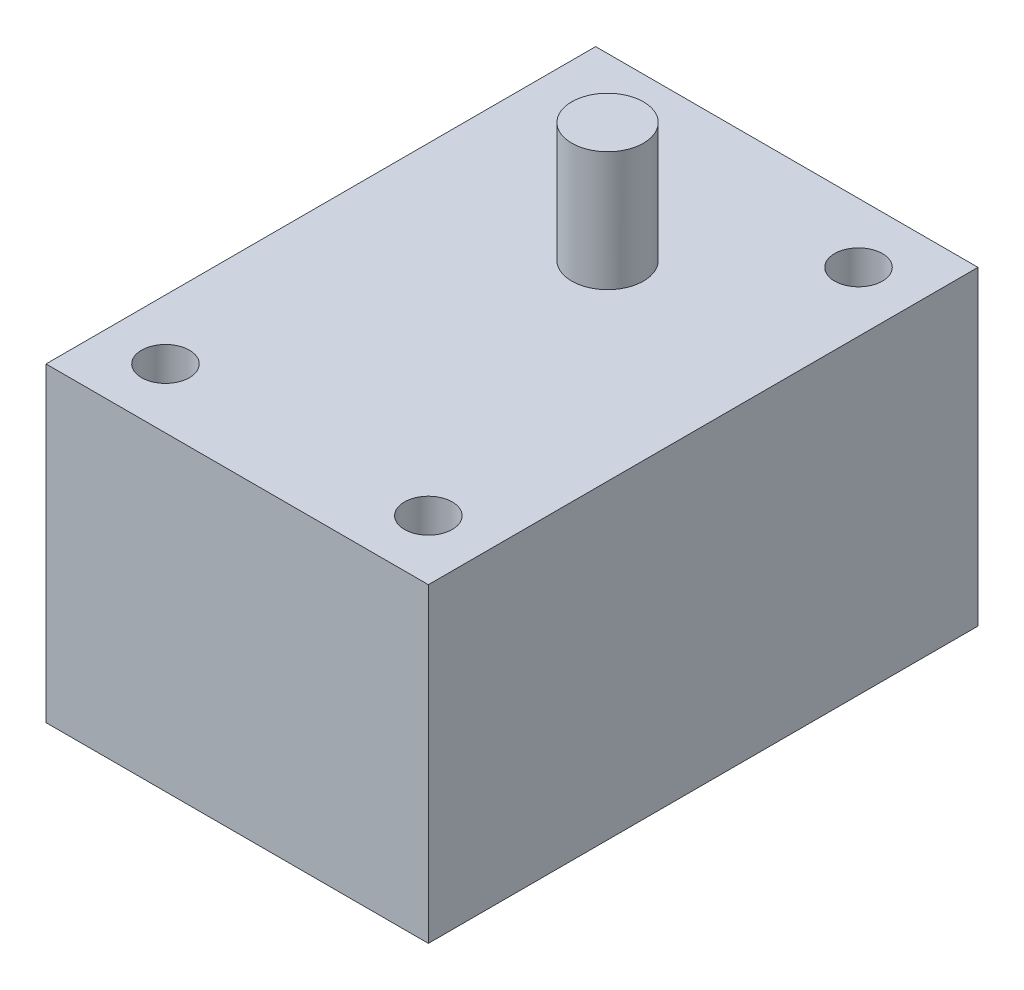
ISO-10303-21;
HEADER;
FILE_DESCRIPTION(('STEP AP214'),'2;1');
FILE_NAME('part.step','',(''),(''),'','','');
FILE_SCHEMA(('AUTOMOTIVE_DESIGN { 1 0 10303 214 1 1 1 1 }'));
ENDSEC;
DATA;
#1=APPLICATION_CONTEXT('core data for automotive mechanical design processes');
#2=APPLICATION_PROTOCOL_DEFINITION('international standard','automotive_design',2000,#1);
#3=PRODUCT_CONTEXT('',#1,'mechanical');
#4=PRODUCT('Part','Part','',(#3));
#5=PRODUCT_RELATED_PRODUCT_CATEGORY('part','',(#4));
#6=PRODUCT_DEFINITION_FORMATION('','',#4);
#7=PRODUCT_DEFINITION_CONTEXT('part definition',#1,'design');
#8=PRODUCT_DEFINITION('design','',#6,#7);
#9=PRODUCT_DEFINITION_SHAPE('','',#8);
#10=(LENGTH_UNIT() NAMED_UNIT(*) SI_UNIT(.MILLI.,.METRE.));
#11=(NAMED_UNIT(*) PLANE_ANGLE_UNIT() SI_UNIT($,.RADIAN.));
#12=(NAMED_UNIT(*) SI_UNIT($,.STERADIAN.) SOLID_ANGLE_UNIT());
#13=UNCERTAINTY_MEASURE_WITH_UNIT(LENGTH_MEASURE(1.E-05),#10,'distance_accuracy_value','');
#14=(GEOMETRIC_REPRESENTATION_CONTEXT(3) GLOBAL_UNCERTAINTY_ASSIGNED_CONTEXT((#13)) GLOBAL_UNIT_ASSIGNED_CONTEXT((#10,
#11,#12)) REPRESENTATION_CONTEXT('',''));
#15=CARTESIAN_POINT('',(0.,0.,0.));
#16=DIRECTION('',(0.,0.,1.));
#17=DIRECTION('',(1.,0.,0.));
#18=AXIS2_PLACEMENT_3D('',#15,#16,#17);
#19=CARTESIAN_POINT('',(0.,0.,46.));
#20=DIRECTION('',(1.,0.,0.));
#21=DIRECTION('',(0.,0.,-1.));
#22=AXIS2_PLACEMENT_3D('',#19,#20,#21);
#23=PLANE('',#22);
#24=DIRECTION('',(0.,-1.,0.));
#25=VECTOR('',#24,1.);
#26=CARTESIAN_POINT('',(0.,0.,0.));
#27=LINE('',#26,#25);
#28=CARTESIAN_POINT('',(0.,26.,0.));
#29=VERTEX_POINT('',#28);
#30=CARTESIAN_POINT('',(0.,0.,0.));
#31=VERTEX_POINT('',#30);
#32=EDGE_CURVE('E100',#29,#31,#27,.T.);
#33=ORIENTED_EDGE('',*,*,#32,.T.);
#34=DIRECTION('',(0.,0.,-1.));
#35=VECTOR('',#34,1.);
#36=CARTESIAN_POINT('',(0.,0.,46.));
#37=LINE('',#36,#35);
#38=CARTESIAN_POINT('',(0.,0.,46.));
#39=VERTEX_POINT('',#38);
#40=EDGE_CURVE('E42',#39,#31,#37,.T.);
#41=ORIENTED_EDGE('',*,*,#40,.F.);
#42=DIRECTION('',(0.,-1.,0.));
#43=VECTOR('',#42,1.);
#44=CARTESIAN_POINT('',(0.,0.,46.));
#45=LINE('',#44,#43);
#46=CARTESIAN_POINT('',(0.,26.,46.));
#47=VERTEX_POINT('',#46);
#48=EDGE_CURVE('E86',#47,#39,#45,.T.);
#49=ORIENTED_EDGE('',*,*,#48,.F.);
#50=DIRECTION('',(0.,0.,-1.));
#51=VECTOR('',#50,1.);
#52=CARTESIAN_POINT('',(0.,26.,46.));
#53=LINE('',#52,#51);
#54=EDGE_CURVE('E96',#47,#29,#53,.T.);
#55=ORIENTED_EDGE('',*,*,#54,.T.);
#56=EDGE_LOOP('',(#33,#41,#49,#55));
#57=FACE_BOUND('',#56,.T.);
#58=ADVANCED_FACE('F34',(#57),#23,.F.);
#59=CARTESIAN_POINT('',(0.,0.,46.));
#60=DIRECTION('',(0.,1.,0.));
#61=DIRECTION('',(0.,0.,1.));
#62=AXIS2_PLACEMENT_3D('',#59,#60,#61);
#63=PLANE('',#62);
#64=DIRECTION('',(1.,0.,0.));
#65=VECTOR('',#64,1.);
#66=CARTESIAN_POINT('',(0.,0.,0.));
#67=LINE('',#66,#65);
#68=CARTESIAN_POINT('',(32.,0.,0.));
#69=VERTEX_POINT('',#68);
#70=EDGE_CURVE('E91',#31,#69,#67,.T.);
#71=ORIENTED_EDGE('',*,*,#70,.T.);
#72=DIRECTION('',(0.,0.,-1.));
#73=VECTOR('',#72,1.);
#74=CARTESIAN_POINT('',(32.,0.,46.));
#75=LINE('',#74,#73);
#76=CARTESIAN_POINT('',(32.,0.,46.));
#77=VERTEX_POINT('',#76);
#78=EDGE_CURVE('E89',#77,#69,#75,.T.);
#79=ORIENTED_EDGE('',*,*,#78,.F.);
#80=DIRECTION('',(1.,0.,0.));
#81=VECTOR('',#80,1.);
#82=CARTESIAN_POINT('',(0.,0.,46.));
#83=LINE('',#82,#81);
#84=EDGE_CURVE('E81',#39,#77,#83,.T.);
#85=ORIENTED_EDGE('',*,*,#84,.F.);
#86=ORIENTED_EDGE('',*,*,#40,.T.);
#87=EDGE_LOOP('',(#71,#79,#85,#86));
#88=FACE_BOUND('',#87,.T.);
#89=ADVANCED_FACE('F90',(#88),#63,.F.);
#90=CARTESIAN_POINT('',(32.,0.,46.));
#91=DIRECTION('',(-1.,0.,0.));
#92=DIRECTION('',(0.,0.,1.));
#93=AXIS2_PLACEMENT_3D('',#90,#91,#92);
#94=PLANE('',#93);
#95=DIRECTION('',(0.,1.,0.));
#96=VECTOR('',#95,1.);
#97=CARTESIAN_POINT('',(32.,0.,0.));
#98=LINE('',#97,#96);
#99=CARTESIAN_POINT('',(32.,26.,0.));
#100=VERTEX_POINT('',#99);
#101=EDGE_CURVE('E67',#69,#100,#98,.T.);
#102=ORIENTED_EDGE('',*,*,#101,.T.);
#103=DIRECTION('',(0.,0.,-1.));
#104=VECTOR('',#103,1.);
#105=CARTESIAN_POINT('',(32.,26.,46.));
#106=LINE('',#105,#104);
#107=CARTESIAN_POINT('',(32.,26.,46.));
#108=VERTEX_POINT('',#107);
#109=EDGE_CURVE('E92',#108,#100,#106,.T.);
#110=ORIENTED_EDGE('',*,*,#109,.F.);
#111=DIRECTION('',(0.,1.,0.));
#112=VECTOR('',#111,1.);
#113=CARTESIAN_POINT('',(32.,0.,46.));
#114=LINE('',#113,#112);
#115=EDGE_CURVE('E84',#77,#108,#114,.T.);
#116=ORIENTED_EDGE('',*,*,#115,.F.);
#117=ORIENTED_EDGE('',*,*,#78,.T.);
#118=EDGE_LOOP('',(#102,#110,#116,#117));
#119=FACE_BOUND('',#118,.T.);
#120=ADVANCED_FACE('F94',(#119),#94,.F.);
#121=CARTESIAN_POINT('',(0.,26.,46.));
#122=DIRECTION('',(0.,-1.,0.));
#123=DIRECTION('',(0.,0.,-1.));
#124=AXIS2_PLACEMENT_3D('',#121,#122,#123);
#125=PLANE('',#124);
#126=CARTESIAN_POINT('',(16.,26.,15.));
#127=DIRECTION('',(0.,-1.,0.));
#128=DIRECTION('',(0.,0.,-1.));
#129=AXIS2_PLACEMENT_3D('',#126,#127,#128);
#130=CIRCLE('',#129,3.);
#131=CARTESIAN_POINT('',(16.,26.,12.));
#132=VERTEX_POINT('',#131);
#133=EDGE_CURVE('E11',#132,#132,#130,.F.);
#134=ORIENTED_EDGE('',*,*,#133,.F.);
#135=EDGE_LOOP('',(#134));
#136=FACE_BOUND('',#135,.T.);
#137=CARTESIAN_POINT('',(5.,26.,41.));
#138=DIRECTION('',(0.,1.,0.));
#139=DIRECTION('',(0.,0.,1.));
#140=AXIS2_PLACEMENT_3D('',#137,#138,#139);
#141=CIRCLE('',#140,2.);
#142=CARTESIAN_POINT('',(5.,26.,43.));
#143=VERTEX_POINT('',#142);
#144=EDGE_CURVE('E142',#143,#143,#141,.T.);
#145=ORIENTED_EDGE('',*,*,#144,.F.);
#146=EDGE_LOOP('',(#145));
#147=FACE_BOUND('',#146,.T.);
#148=CARTESIAN_POINT('',(27.,26.,41.));
#149=DIRECTION('',(0.,1.,0.));
#150=DIRECTION('',(0.,0.,1.));
#151=AXIS2_PLACEMENT_3D('',#148,#149,#150);
#152=CIRCLE('',#151,2.);
#153=CARTESIAN_POINT('',(27.,26.,43.));
#154=VERTEX_POINT('',#153);
#155=EDGE_CURVE('E146',#154,#154,#152,.T.);
#156=ORIENTED_EDGE('',*,*,#155,.F.);
#157=EDGE_LOOP('',(#156));
#158=FACE_BOUND('',#157,.T.);
#159=CARTESIAN_POINT('',(27.,26.,5.));
#160=DIRECTION('',(0.,1.,0.));
#161=DIRECTION('',(0.,0.,1.));
#162=AXIS2_PLACEMENT_3D('',#159,#160,#161);
#163=CIRCLE('',#162,2.);
#164=CARTESIAN_POINT('',(27.,26.,7.));
#165=VERTEX_POINT('',#164);
#166=EDGE_CURVE('E150',#165,#165,#163,.T.);
#167=ORIENTED_EDGE('',*,*,#166,.F.);
#168=EDGE_LOOP('',(#167));
#169=FACE_BOUND('',#168,.T.);
#170=CARTESIAN_POINT('',(5.,26.,5.));
#171=DIRECTION('',(0.,1.,0.));
#172=DIRECTION('',(0.,0.,1.));
#173=AXIS2_PLACEMENT_3D('',#170,#171,#172);
#174=CIRCLE('',#173,2.);
#175=CARTESIAN_POINT('',(5.,26.,7.));
#176=VERTEX_POINT('',#175);
#177=EDGE_CURVE('E153',#176,#176,#174,.T.);
#178=ORIENTED_EDGE('',*,*,#177,.F.);
#179=EDGE_LOOP('',(#178));
#180=FACE_BOUND('',#179,.T.);
#181=DIRECTION('',(-1.,0.,0.));
#182=VECTOR('',#181,1.);
#183=CARTESIAN_POINT('',(0.,26.,0.));
#184=LINE('',#183,#182);
#185=EDGE_CURVE('E73',#100,#29,#184,.T.);
#186=ORIENTED_EDGE('',*,*,#185,.T.);
#187=ORIENTED_EDGE('',*,*,#54,.F.);
#188=DIRECTION('',(-1.,0.,0.));
#189=VECTOR('',#188,1.);
#190=CARTESIAN_POINT('',(0.,26.,46.));
#191=LINE('',#190,#189);
#192=EDGE_CURVE('E50',#108,#47,#191,.T.);
#193=ORIENTED_EDGE('',*,*,#192,.F.);
#194=ORIENTED_EDGE('',*,*,#109,.T.);
#195=EDGE_LOOP('',(#186,#187,#193,#194));
#196=FACE_BOUND('',#195,.T.);
#197=ADVANCED_FACE('F122',(#136,#147,#158,#169,#180,#196),#125,.F.);
#198=CARTESIAN_POINT('',(0.,0.,46.));
#199=DIRECTION('',(0.,0.,-1.));
#200=DIRECTION('',(-1.,0.,0.));
#201=AXIS2_PLACEMENT_3D('',#198,#199,#200);
#202=PLANE('',#201);
#203=ORIENTED_EDGE('',*,*,#48,.T.);
#204=ORIENTED_EDGE('',*,*,#84,.T.);
#205=ORIENTED_EDGE('',*,*,#115,.T.);
#206=ORIENTED_EDGE('',*,*,#192,.T.);
#207=EDGE_LOOP('',(#203,#204,#205,#206));
#208=FACE_BOUND('',#207,.T.);
#209=ADVANCED_FACE('F82',(#208),#202,.F.);
#210=CARTESIAN_POINT('',(0.,0.,0.));
#211=DIRECTION('',(0.,0.,-1.));
#212=DIRECTION('',(-1.,0.,0.));
#213=AXIS2_PLACEMENT_3D('',#210,#211,#212);
#214=PLANE('',#213);
#215=ORIENTED_EDGE('',*,*,#32,.F.);
#216=ORIENTED_EDGE('',*,*,#185,.F.);
#217=ORIENTED_EDGE('',*,*,#101,.F.);
#218=ORIENTED_EDGE('',*,*,#70,.F.);
#219=EDGE_LOOP('',(#215,#216,#217,#218));
#220=FACE_BOUND('',#219,.T.);
#221=ADVANCED_FACE('F111',(#220),#214,.T.);
#222=CARTESIAN_POINT('',(5.,16.,5.));
#223=DIRECTION('',(0.,1.,0.));
#224=DIRECTION('',(0.,0.,1.));
#225=AXIS2_PLACEMENT_3D('',#222,#223,#224);
#226=CYLINDRICAL_SURFACE('',#225,2.);
#227=CARTESIAN_POINT('',(5.,16.,5.));
#228=DIRECTION('',(0.,1.,0.));
#229=DIRECTION('',(0.,0.,1.));
#230=AXIS2_PLACEMENT_3D('',#227,#228,#229);
#231=CIRCLE('',#230,2.);
#232=CARTESIAN_POINT('',(5.,16.,7.));
#233=VERTEX_POINT('',#232);
#234=EDGE_CURVE('E103',#233,#233,#231,.T.);
#235=ORIENTED_EDGE('',*,*,#234,.F.);
#236=EDGE_LOOP('',(#235));
#237=FACE_BOUND('',#236,.T.);
#238=ORIENTED_EDGE('',*,*,#177,.T.);
#239=EDGE_LOOP('',(#238));
#240=FACE_BOUND('',#239,.T.);
#241=ADVANCED_FACE('F113',(#237,#240),#226,.F.);
#242=CARTESIAN_POINT('',(5.,16.,5.));
#243=DIRECTION('',(0.,1.,0.));
#244=DIRECTION('',(0.,0.,1.));
#245=AXIS2_PLACEMENT_3D('',#242,#243,#244);
#246=PLANE('',#245);
#247=ORIENTED_EDGE('',*,*,#234,.T.);
#248=EDGE_LOOP('',(#247));
#249=FACE_BOUND('',#248,.T.);
#250=ADVANCED_FACE('F119',(#249),#246,.T.);
#251=CARTESIAN_POINT('',(27.,16.,5.));
#252=DIRECTION('',(0.,1.,0.));
#253=DIRECTION('',(0.,0.,1.));
#254=AXIS2_PLACEMENT_3D('',#251,#252,#253);
#255=CYLINDRICAL_SURFACE('',#254,2.);
#256=CARTESIAN_POINT('',(27.,16.,5.));
#257=DIRECTION('',(0.,1.,0.));
#258=DIRECTION('',(0.,0.,1.));
#259=AXIS2_PLACEMENT_3D('',#256,#257,#258);
#260=CIRCLE('',#259,2.);
#261=CARTESIAN_POINT('',(27.,16.,7.));
#262=VERTEX_POINT('',#261);
#263=EDGE_CURVE('E155',#262,#262,#260,.T.);
#264=ORIENTED_EDGE('',*,*,#263,.F.);
#265=EDGE_LOOP('',(#264));
#266=FACE_BOUND('',#265,.T.);
#267=ORIENTED_EDGE('',*,*,#166,.T.);
#268=EDGE_LOOP('',(#267));
#269=FACE_BOUND('',#268,.T.);
#270=ADVANCED_FACE('F205',(#266,#269),#255,.F.);
#271=CARTESIAN_POINT('',(27.,16.,5.));
#272=DIRECTION('',(0.,1.,0.));
#273=DIRECTION('',(0.,0.,1.));
#274=AXIS2_PLACEMENT_3D('',#271,#272,#273);
#275=PLANE('',#274);
#276=ORIENTED_EDGE('',*,*,#263,.T.);
#277=EDGE_LOOP('',(#276));
#278=FACE_BOUND('',#277,.T.);
#279=ADVANCED_FACE('F201',(#278),#275,.T.);
#280=CARTESIAN_POINT('',(27.,16.,41.));
#281=DIRECTION('',(0.,1.,0.));
#282=DIRECTION('',(0.,0.,1.));
#283=AXIS2_PLACEMENT_3D('',#280,#281,#282);
#284=CYLINDRICAL_SURFACE('',#283,2.);
#285=CARTESIAN_POINT('',(27.,16.,41.));
#286=DIRECTION('',(0.,1.,0.));
#287=DIRECTION('',(0.,0.,1.));
#288=AXIS2_PLACEMENT_3D('',#285,#286,#287);
#289=CIRCLE('',#288,2.);
#290=CARTESIAN_POINT('',(27.,16.,43.));
#291=VERTEX_POINT('',#290);
#292=EDGE_CURVE('E162',#291,#291,#289,.T.);
#293=ORIENTED_EDGE('',*,*,#292,.F.);
#294=EDGE_LOOP('',(#293));
#295=FACE_BOUND('',#294,.T.);
#296=ORIENTED_EDGE('',*,*,#155,.T.);
#297=EDGE_LOOP('',(#296));
#298=FACE_BOUND('',#297,.T.);
#299=ADVANCED_FACE('F197',(#295,#298),#284,.F.);
#300=CARTESIAN_POINT('',(27.,16.,41.));
#301=DIRECTION('',(0.,1.,0.));
#302=DIRECTION('',(0.,0.,1.));
#303=AXIS2_PLACEMENT_3D('',#300,#301,#302);
#304=PLANE('',#303);
#305=ORIENTED_EDGE('',*,*,#292,.T.);
#306=EDGE_LOOP('',(#305));
#307=FACE_BOUND('',#306,.T.);
#308=ADVANCED_FACE('F193',(#307),#304,.T.);
#309=CARTESIAN_POINT('',(5.,16.,41.));
#310=DIRECTION('',(0.,1.,0.));
#311=DIRECTION('',(0.,0.,1.));
#312=AXIS2_PLACEMENT_3D('',#309,#310,#311);
#313=CYLINDRICAL_SURFACE('',#312,2.);
#314=CARTESIAN_POINT('',(5.,16.,41.));
#315=DIRECTION('',(0.,1.,0.));
#316=DIRECTION('',(0.,0.,1.));
#317=AXIS2_PLACEMENT_3D('',#314,#315,#316);
#318=CIRCLE('',#317,2.);
#319=CARTESIAN_POINT('',(5.,16.,43.));
#320=VERTEX_POINT('',#319);
#321=EDGE_CURVE('E165',#320,#320,#318,.T.);
#322=ORIENTED_EDGE('',*,*,#321,.F.);
#323=EDGE_LOOP('',(#322));
#324=FACE_BOUND('',#323,.T.);
#325=ORIENTED_EDGE('',*,*,#144,.T.);
#326=EDGE_LOOP('',(#325));
#327=FACE_BOUND('',#326,.T.);
#328=ADVANCED_FACE('F187',(#324,#327),#313,.F.);
#329=CARTESIAN_POINT('',(5.,16.,41.));
#330=DIRECTION('',(0.,1.,0.));
#331=DIRECTION('',(0.,0.,1.));
#332=AXIS2_PLACEMENT_3D('',#329,#330,#331);
#333=PLANE('',#332);
#334=ORIENTED_EDGE('',*,*,#321,.T.);
#335=EDGE_LOOP('',(#334));
#336=FACE_BOUND('',#335,.T.);
#337=ADVANCED_FACE('F180',(#336),#333,.T.);
#338=CARTESIAN_POINT('',(16.,36.,15.));
#339=DIRECTION('',(0.,-1.,0.));
#340=DIRECTION('',(0.,0.,-1.));
#341=AXIS2_PLACEMENT_3D('',#338,#339,#340);
#342=CYLINDRICAL_SURFACE('',#341,3.);
#343=CARTESIAN_POINT('',(16.,36.,15.));
#344=DIRECTION('',(0.,1.,0.));
#345=DIRECTION('',(0.,0.,1.));
#346=AXIS2_PLACEMENT_3D('',#343,#344,#345);
#347=CIRCLE('',#346,3.);
#348=CARTESIAN_POINT('',(16.,36.,18.));
#349=VERTEX_POINT('',#348);
#350=EDGE_CURVE('E169',#349,#349,#347,.T.);
#351=ORIENTED_EDGE('',*,*,#350,.F.);
#352=EDGE_LOOP('',(#351));
#353=FACE_BOUND('',#352,.T.);
#354=ORIENTED_EDGE('',*,*,#133,.T.);
#355=EDGE_LOOP('',(#354));
#356=FACE_BOUND('',#355,.T.);
#357=ADVANCED_FACE('F177',(#353,#356),#342,.T.);
#358=CARTESIAN_POINT('',(0.,36.,0.));
#359=DIRECTION('',(0.,1.,0.));
#360=DIRECTION('',(0.,0.,1.));
#361=AXIS2_PLACEMENT_3D('',#358,#359,#360);
#362=PLANE('',#361);
#363=ORIENTED_EDGE('',*,*,#350,.T.);
#364=EDGE_LOOP('',(#363));
#365=FACE_BOUND('',#364,.T.);
#366=ADVANCED_FACE('F175',(#365),#362,.T.);
#367=CLOSED_SHELL('',(#58,#89,#120,#197,#209,#221,#241,#250,#270,#279,#299,#308,#328,#337,#357,#366));
#368=MANIFOLD_SOLID_BREP('B2',#367);
#369=ADVANCED_BREP_SHAPE_REPRESENTATION('',(#18,#368),#14);
#370=SHAPE_DEFINITION_REPRESENTATION(#9,#369);
ENDSEC;
END-ISO-10303-21;
